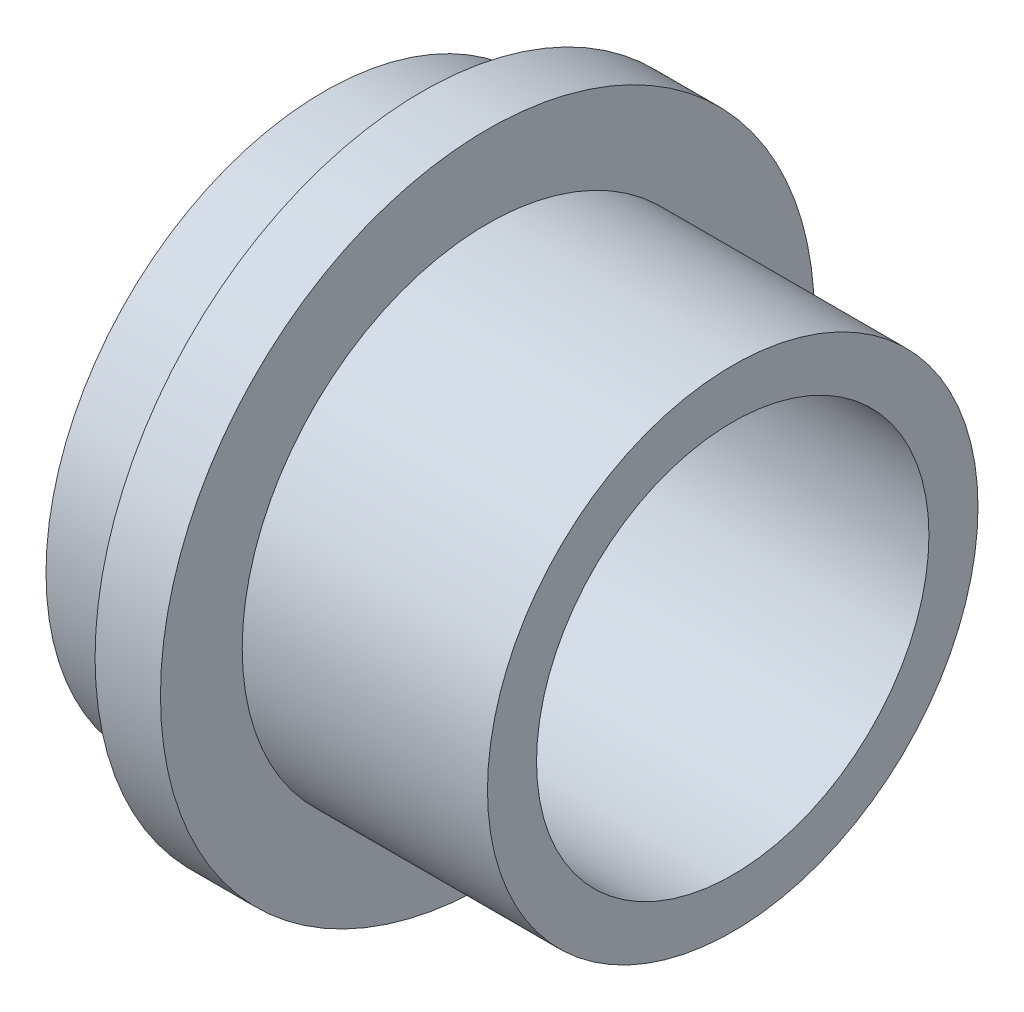
ISO-10303-21;
HEADER;
FILE_DESCRIPTION(('STEP AP214'),'2;1');
FILE_NAME('part.step','',(''),(''),'','','');
FILE_SCHEMA(('AUTOMOTIVE_DESIGN { 1 0 10303 214 1 1 1 1 }'));
ENDSEC;
DATA;
#1=APPLICATION_CONTEXT('core data for automotive mechanical design processes');
#2=APPLICATION_PROTOCOL_DEFINITION('international standard','automotive_design',2000,#1);
#3=PRODUCT_CONTEXT('',#1,'mechanical');
#4=PRODUCT('Part','Part','',(#3));
#5=PRODUCT_RELATED_PRODUCT_CATEGORY('part','',(#4));
#6=PRODUCT_DEFINITION_FORMATION('','',#4);
#7=PRODUCT_DEFINITION_CONTEXT('part definition',#1,'design');
#8=PRODUCT_DEFINITION('design','',#6,#7);
#9=PRODUCT_DEFINITION_SHAPE('','',#8);
#10=(LENGTH_UNIT() NAMED_UNIT(*) SI_UNIT(.MILLI.,.METRE.));
#11=(NAMED_UNIT(*) PLANE_ANGLE_UNIT() SI_UNIT($,.RADIAN.));
#12=(NAMED_UNIT(*) SI_UNIT($,.STERADIAN.) SOLID_ANGLE_UNIT());
#13=UNCERTAINTY_MEASURE_WITH_UNIT(LENGTH_MEASURE(1.E-05),#10,'distance_accuracy_value','');
#14=(GEOMETRIC_REPRESENTATION_CONTEXT(3) GLOBAL_UNCERTAINTY_ASSIGNED_CONTEXT((#13)) GLOBAL_UNIT_ASSIGNED_CONTEXT((#10,
#11,#12)) REPRESENTATION_CONTEXT('',''));
#15=CARTESIAN_POINT('',(0.,0.,0.));
#16=DIRECTION('',(0.,0.,1.));
#17=DIRECTION('',(1.,0.,0.));
#18=AXIS2_PLACEMENT_3D('',#15,#16,#17);
#19=CARTESIAN_POINT('',(12.5,4.,-4.));
#20=DIRECTION('',(0.,0.,-1.));
#21=DIRECTION('',(0.,1.,0.));
#22=AXIS2_PLACEMENT_3D('',#19,#20,#21);
#23=PLANE('',#22);
#24=DIRECTION('',(0.,-1.,0.));
#25=VECTOR('',#24,1.);
#26=CARTESIAN_POINT('',(2.5,4.,-4.));
#27=LINE('',#26,#25);
#28=CARTESIAN_POINT('',(2.5,4.,-4.));
#29=VERTEX_POINT('',#28);
#30=CARTESIAN_POINT('',(2.5,-4.,-4.));
#31=VERTEX_POINT('',#30);
#32=EDGE_CURVE('E49',#29,#31,#27,.T.);
#33=ORIENTED_EDGE('',*,*,#32,.F.);
#34=DIRECTION('',(-1.,0.,0.));
#35=VECTOR('',#34,1.);
#36=CARTESIAN_POINT('',(12.5,4.,-4.));
#37=LINE('',#36,#35);
#38=CARTESIAN_POINT('',(0.,4.,-4.));
#39=VERTEX_POINT('',#38);
#40=EDGE_CURVE('E92',#29,#39,#37,.T.);
#41=ORIENTED_EDGE('',*,*,#40,.T.);
#42=DIRECTION('',(0.,-1.,0.));
#43=VECTOR('',#42,1.);
#44=CARTESIAN_POINT('',(0.,4.,-4.));
#45=LINE('',#44,#43);
#46=CARTESIAN_POINT('',(0.,-4.,-4.));
#47=VERTEX_POINT('',#46);
#48=EDGE_CURVE('E184',#39,#47,#45,.T.);
#49=ORIENTED_EDGE('',*,*,#48,.T.);
#50=DIRECTION('',(-1.,0.,0.));
#51=VECTOR('',#50,1.);
#52=CARTESIAN_POINT('',(12.5,-4.,-4.));
#53=LINE('',#52,#51);
#54=EDGE_CURVE('E56',#31,#47,#53,.T.);
#55=ORIENTED_EDGE('',*,*,#54,.F.);
#56=EDGE_LOOP('',(#33,#41,#49,#55));
#57=FACE_BOUND('',#56,.T.);
#58=ADVANCED_FACE('F35',(#57),#23,.F.);
#59=CARTESIAN_POINT('',(12.5,4.,-4.));
#60=DIRECTION('',(0.,1.,0.));
#61=DIRECTION('',(0.,0.,1.));
#62=AXIS2_PLACEMENT_3D('',#59,#60,#61);
#63=PLANE('',#62);
#64=DIRECTION('',(0.,0.,-1.));
#65=VECTOR('',#64,1.);
#66=CARTESIAN_POINT('',(2.5,4.,-4.));
#67=LINE('',#66,#65);
#68=CARTESIAN_POINT('',(2.5,4.,4.));
#69=VERTEX_POINT('',#68);
#70=EDGE_CURVE('E84',#69,#29,#67,.T.);
#71=ORIENTED_EDGE('',*,*,#70,.F.);
#72=DIRECTION('',(-1.,0.,0.));
#73=VECTOR('',#72,1.);
#74=CARTESIAN_POINT('',(12.5,4.,4.));
#75=LINE('',#74,#73);
#76=CARTESIAN_POINT('',(0.,4.,4.));
#77=VERTEX_POINT('',#76);
#78=EDGE_CURVE('E83',#69,#77,#75,.T.);
#79=ORIENTED_EDGE('',*,*,#78,.T.);
#80=DIRECTION('',(0.,0.,-1.));
#81=VECTOR('',#80,1.);
#82=CARTESIAN_POINT('',(0.,4.,-4.));
#83=LINE('',#82,#81);
#84=EDGE_CURVE('E94',#77,#39,#83,.T.);
#85=ORIENTED_EDGE('',*,*,#84,.T.);
#86=ORIENTED_EDGE('',*,*,#40,.F.);
#87=EDGE_LOOP('',(#71,#79,#85,#86));
#88=FACE_BOUND('',#87,.T.);
#89=ADVANCED_FACE('F158',(#88),#63,.F.);
#90=CARTESIAN_POINT('',(12.5,4.,4.));
#91=DIRECTION('',(0.,0.,1.));
#92=DIRECTION('',(0.,-1.,0.));
#93=AXIS2_PLACEMENT_3D('',#90,#91,#92);
#94=PLANE('',#93);
#95=DIRECTION('',(0.,1.,0.));
#96=VECTOR('',#95,1.);
#97=CARTESIAN_POINT('',(2.5,4.,4.));
#98=LINE('',#97,#96);
#99=CARTESIAN_POINT('',(2.5,-4.,4.));
#100=VERTEX_POINT('',#99);
#101=EDGE_CURVE('E75',#100,#69,#98,.T.);
#102=ORIENTED_EDGE('',*,*,#101,.F.);
#103=DIRECTION('',(-1.,0.,0.));
#104=VECTOR('',#103,1.);
#105=CARTESIAN_POINT('',(12.5,-4.,4.));
#106=LINE('',#105,#104);
#107=CARTESIAN_POINT('',(0.,-4.,4.));
#108=VERTEX_POINT('',#107);
#109=EDGE_CURVE('E82',#100,#108,#106,.T.);
#110=ORIENTED_EDGE('',*,*,#109,.T.);
#111=DIRECTION('',(0.,1.,0.));
#112=VECTOR('',#111,1.);
#113=CARTESIAN_POINT('',(0.,4.,4.));
#114=LINE('',#113,#112);
#115=EDGE_CURVE('E187',#108,#77,#114,.T.);
#116=ORIENTED_EDGE('',*,*,#115,.T.);
#117=ORIENTED_EDGE('',*,*,#78,.F.);
#118=EDGE_LOOP('',(#102,#110,#116,#117));
#119=FACE_BOUND('',#118,.T.);
#120=ADVANCED_FACE('F80',(#119),#94,.F.);
#121=CARTESIAN_POINT('',(12.5,-4.,-4.));
#122=DIRECTION('',(0.,-1.,0.));
#123=DIRECTION('',(0.,0.,-1.));
#124=AXIS2_PLACEMENT_3D('',#121,#122,#123);
#125=PLANE('',#124);
#126=DIRECTION('',(0.,0.,1.));
#127=VECTOR('',#126,1.);
#128=CARTESIAN_POINT('',(2.5,-4.,-4.));
#129=LINE('',#128,#127);
#130=EDGE_CURVE('E11',#31,#100,#129,.T.);
#131=ORIENTED_EDGE('',*,*,#130,.F.);
#132=ORIENTED_EDGE('',*,*,#54,.T.);
#133=DIRECTION('',(0.,0.,1.));
#134=VECTOR('',#133,1.);
#135=CARTESIAN_POINT('',(0.,-4.,-4.));
#136=LINE('',#135,#134);
#137=EDGE_CURVE('E89',#47,#108,#136,.T.);
#138=ORIENTED_EDGE('',*,*,#137,.T.);
#139=ORIENTED_EDGE('',*,*,#109,.F.);
#140=EDGE_LOOP('',(#131,#132,#138,#139));
#141=FACE_BOUND('',#140,.T.);
#142=ADVANCED_FACE('F87',(#141),#125,.F.);
#143=CARTESIAN_POINT('',(0.,0.,0.));
#144=DIRECTION('',(1.,0.,0.));
#145=DIRECTION('',(0.,0.,-1.));
#146=AXIS2_PLACEMENT_3D('',#143,#144,#145);
#147=PLANE('',#146);
#148=ORIENTED_EDGE('',*,*,#137,.F.);
#149=ORIENTED_EDGE('',*,*,#48,.F.);
#150=ORIENTED_EDGE('',*,*,#84,.F.);
#151=ORIENTED_EDGE('',*,*,#115,.F.);
#152=EDGE_LOOP('',(#148,#149,#150,#151));
#153=FACE_BOUND('',#152,.T.);
#154=CARTESIAN_POINT('',(0.,0.,0.));
#155=DIRECTION('',(-1.,0.,0.));
#156=DIRECTION('',(0.,0.,1.));
#157=AXIS2_PLACEMENT_3D('',#154,#155,#156);
#158=CIRCLE('',#157,8.5);
#159=CARTESIAN_POINT('',(0.,0.,8.5));
#160=VERTEX_POINT('',#159);
#161=EDGE_CURVE('E43',#160,#160,#158,.T.);
#162=ORIENTED_EDGE('',*,*,#161,.T.);
#163=EDGE_LOOP('',(#162));
#164=FACE_BOUND('',#163,.T.);
#165=ADVANCED_FACE('F37',(#153,#164),#147,.F.);
#166=CARTESIAN_POINT('',(-59.6035396155649,0.,0.));
#167=DIRECTION('',(-1.,0.,0.));
#168=DIRECTION('',(0.,0.,1.));
#169=AXIS2_PLACEMENT_3D('',#166,#167,#168);
#170=CYLINDRICAL_SURFACE('',#169,8.5);
#171=ORIENTED_EDGE('',*,*,#161,.F.);
#172=EDGE_LOOP('',(#171));
#173=FACE_BOUND('',#172,.T.);
#174=CARTESIAN_POINT('',(3.,0.,0.));
#175=DIRECTION('',(-1.,0.,0.));
#176=DIRECTION('',(0.,0.,1.));
#177=AXIS2_PLACEMENT_3D('',#174,#175,#176);
#178=CIRCLE('',#177,8.5);
#179=CARTESIAN_POINT('',(3.,0.,8.5));
#180=VERTEX_POINT('',#179);
#181=EDGE_CURVE('E110',#180,#180,#178,.T.);
#182=ORIENTED_EDGE('',*,*,#181,.T.);
#183=EDGE_LOOP('',(#182));
#184=FACE_BOUND('',#183,.T.);
#185=ADVANCED_FACE('F116',(#173,#184),#170,.T.);
#186=CARTESIAN_POINT('',(3.,9.09366399233855,0.));
#187=DIRECTION('',(1.,0.,0.));
#188=DIRECTION('',(0.,0.,-1.));
#189=AXIS2_PLACEMENT_3D('',#186,#187,#188);
#190=PLANE('',#189);
#191=ORIENTED_EDGE('',*,*,#181,.F.);
#192=EDGE_LOOP('',(#191));
#193=FACE_BOUND('',#192,.T.);
#194=CARTESIAN_POINT('',(3.,0.,0.));
#195=DIRECTION('',(-1.,0.,0.));
#196=DIRECTION('',(0.,0.,1.));
#197=AXIS2_PLACEMENT_3D('',#194,#195,#196);
#198=CIRCLE('',#197,10.);
#199=CARTESIAN_POINT('',(3.,0.,10.));
#200=VERTEX_POINT('',#199);
#201=EDGE_CURVE('E107',#200,#200,#198,.T.);
#202=ORIENTED_EDGE('',*,*,#201,.T.);
#203=EDGE_LOOP('',(#202));
#204=FACE_BOUND('',#203,.T.);
#205=ADVANCED_FACE('F119',(#193,#204),#190,.F.);
#206=CARTESIAN_POINT('',(-59.6035396155649,0.,0.));
#207=DIRECTION('',(-1.,0.,0.));
#208=DIRECTION('',(0.,0.,1.));
#209=AXIS2_PLACEMENT_3D('',#206,#207,#208);
#210=CYLINDRICAL_SURFACE('',#209,10.);
#211=ORIENTED_EDGE('',*,*,#201,.F.);
#212=EDGE_LOOP('',(#211));
#213=FACE_BOUND('',#212,.T.);
#214=CARTESIAN_POINT('',(5.,0.,0.));
#215=DIRECTION('',(-1.,0.,0.));
#216=DIRECTION('',(0.,0.,1.));
#217=AXIS2_PLACEMENT_3D('',#214,#215,#216);
#218=CIRCLE('',#217,10.);
#219=CARTESIAN_POINT('',(5.,0.,10.));
#220=VERTEX_POINT('',#219);
#221=EDGE_CURVE('E104',#220,#220,#218,.T.);
#222=ORIENTED_EDGE('',*,*,#221,.T.);
#223=EDGE_LOOP('',(#222));
#224=FACE_BOUND('',#223,.T.);
#225=ADVANCED_FACE('F124',(#213,#224),#210,.T.);
#226=CARTESIAN_POINT('',(5.,10.,0.));
#227=DIRECTION('',(-1.,0.,0.));
#228=DIRECTION('',(0.,0.,1.));
#229=AXIS2_PLACEMENT_3D('',#226,#227,#228);
#230=PLANE('',#229);
#231=ORIENTED_EDGE('',*,*,#221,.F.);
#232=EDGE_LOOP('',(#231));
#233=FACE_BOUND('',#232,.T.);
#234=CARTESIAN_POINT('',(5.,0.,0.));
#235=DIRECTION('',(-1.,0.,0.));
#236=DIRECTION('',(0.,0.,1.));
#237=AXIS2_PLACEMENT_3D('',#234,#235,#236);
#238=CIRCLE('',#237,7.5);
#239=CARTESIAN_POINT('',(5.,0.,7.5));
#240=VERTEX_POINT('',#239);
#241=EDGE_CURVE('E101',#240,#240,#238,.T.);
#242=ORIENTED_EDGE('',*,*,#241,.T.);
#243=EDGE_LOOP('',(#242));
#244=FACE_BOUND('',#243,.T.);
#245=ADVANCED_FACE('F130',(#233,#244),#230,.F.);
#246=CARTESIAN_POINT('',(-59.6035396155649,0.,0.));
#247=DIRECTION('',(-1.,0.,0.));
#248=DIRECTION('',(0.,0.,1.));
#249=AXIS2_PLACEMENT_3D('',#246,#247,#248);
#250=CYLINDRICAL_SURFACE('',#249,7.5);
#251=ORIENTED_EDGE('',*,*,#241,.F.);
#252=EDGE_LOOP('',(#251));
#253=FACE_BOUND('',#252,.T.);
#254=CARTESIAN_POINT('',(12.5,0.,0.));
#255=DIRECTION('',(-1.,0.,0.));
#256=DIRECTION('',(0.,0.,1.));
#257=AXIS2_PLACEMENT_3D('',#254,#255,#256);
#258=CIRCLE('',#257,7.5);
#259=CARTESIAN_POINT('',(12.5,0.,7.5));
#260=VERTEX_POINT('',#259);
#261=EDGE_CURVE('E98',#260,#260,#258,.T.);
#262=ORIENTED_EDGE('',*,*,#261,.T.);
#263=EDGE_LOOP('',(#262));
#264=FACE_BOUND('',#263,.T.);
#265=ADVANCED_FACE('F136',(#253,#264),#250,.T.);
#266=CARTESIAN_POINT('',(12.5,7.5,0.));
#267=DIRECTION('',(-1.,0.,0.));
#268=DIRECTION('',(0.,0.,1.));
#269=AXIS2_PLACEMENT_3D('',#266,#267,#268);
#270=PLANE('',#269);
#271=CARTESIAN_POINT('',(12.5,0.,0.));
#272=DIRECTION('',(1.,0.,0.));
#273=DIRECTION('',(0.,0.,-1.));
#274=AXIS2_PLACEMENT_3D('',#271,#272,#273);
#275=CIRCLE('',#274,6.);
#276=CARTESIAN_POINT('',(12.5,0.,-6.));
#277=VERTEX_POINT('',#276);
#278=EDGE_CURVE('E178',#277,#277,#275,.T.);
#279=ORIENTED_EDGE('',*,*,#278,.F.);
#280=EDGE_LOOP('',(#279));
#281=FACE_BOUND('',#280,.T.);
#282=ORIENTED_EDGE('',*,*,#261,.F.);
#283=EDGE_LOOP('',(#282));
#284=FACE_BOUND('',#283,.T.);
#285=ADVANCED_FACE('F142',(#281,#284),#270,.F.);
#286=CARTESIAN_POINT('',(2.5,0.,0.));
#287=DIRECTION('',(1.,0.,0.));
#288=DIRECTION('',(0.,0.,-1.));
#289=AXIS2_PLACEMENT_3D('',#286,#287,#288);
#290=PLANE('',#289);
#291=CARTESIAN_POINT('',(2.5,0.,0.));
#292=DIRECTION('',(1.,0.,0.));
#293=DIRECTION('',(0.,0.,-1.));
#294=AXIS2_PLACEMENT_3D('',#291,#292,#293);
#295=CIRCLE('',#294,6.);
#296=CARTESIAN_POINT('',(2.5,0.,-6.));
#297=VERTEX_POINT('',#296);
#298=EDGE_CURVE('E85',#297,#297,#295,.T.);
#299=ORIENTED_EDGE('',*,*,#298,.T.);
#300=EDGE_LOOP('',(#299));
#301=FACE_BOUND('',#300,.T.);
#302=ORIENTED_EDGE('',*,*,#32,.T.);
#303=ORIENTED_EDGE('',*,*,#130,.T.);
#304=ORIENTED_EDGE('',*,*,#101,.T.);
#305=ORIENTED_EDGE('',*,*,#70,.T.);
#306=EDGE_LOOP('',(#302,#303,#304,#305));
#307=FACE_BOUND('',#306,.T.);
#308=ADVANCED_FACE('F74',(#301,#307),#290,.T.);
#309=CARTESIAN_POINT('',(2.5,0.,0.));
#310=DIRECTION('',(1.,0.,0.));
#311=DIRECTION('',(0.,0.,-1.));
#312=AXIS2_PLACEMENT_3D('',#309,#310,#311);
#313=CYLINDRICAL_SURFACE('',#312,6.);
#314=ORIENTED_EDGE('',*,*,#298,.F.);
#315=EDGE_LOOP('',(#314));
#316=FACE_BOUND('',#315,.T.);
#317=ORIENTED_EDGE('',*,*,#278,.T.);
#318=EDGE_LOOP('',(#317));
#319=FACE_BOUND('',#318,.T.);
#320=ADVANCED_FACE('F152',(#316,#319),#313,.F.);
#321=CLOSED_SHELL('',(#58,#89,#120,#142,#165,#185,#205,#225,#245,#265,#285,#308,#320));
#322=MANIFOLD_SOLID_BREP('B2',#321);
#323=ADVANCED_BREP_SHAPE_REPRESENTATION('',(#18,#322),#14);
#324=SHAPE_DEFINITION_REPRESENTATION(#9,#323);
ENDSEC;
END-ISO-10303-21;
